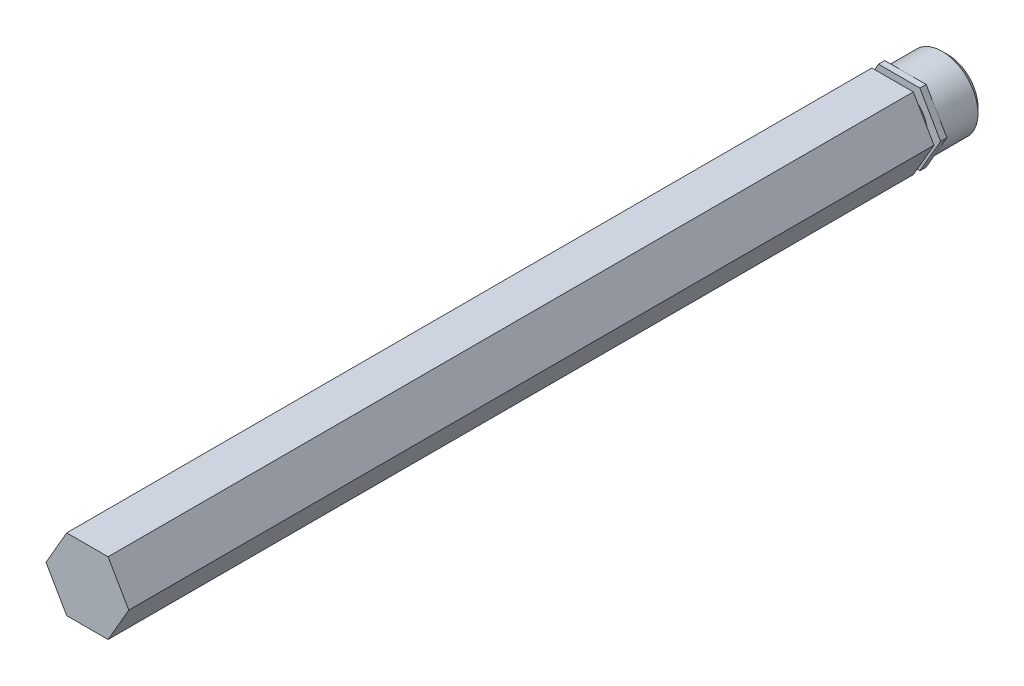
ISO-10303-21;
HEADER;
FILE_DESCRIPTION(('STEP AP214'),'2;1');
FILE_NAME('part.step','',(''),(''),'','','');
FILE_SCHEMA(('AUTOMOTIVE_DESIGN { 1 0 10303 214 1 1 1 1 }'));
ENDSEC;
DATA;
#1=APPLICATION_CONTEXT('core data for automotive mechanical design processes');
#2=APPLICATION_PROTOCOL_DEFINITION('international standard','automotive_design',2000,#1);
#3=PRODUCT_CONTEXT('',#1,'mechanical');
#4=PRODUCT('Part','Part','',(#3));
#5=PRODUCT_RELATED_PRODUCT_CATEGORY('part','',(#4));
#6=PRODUCT_DEFINITION_FORMATION('','',#4);
#7=PRODUCT_DEFINITION_CONTEXT('part definition',#1,'design');
#8=PRODUCT_DEFINITION('design','',#6,#7);
#9=PRODUCT_DEFINITION_SHAPE('','',#8);
#10=(LENGTH_UNIT() NAMED_UNIT(*) SI_UNIT(.MILLI.,.METRE.));
#11=(NAMED_UNIT(*) PLANE_ANGLE_UNIT() SI_UNIT($,.RADIAN.));
#12=(NAMED_UNIT(*) SI_UNIT($,.STERADIAN.) SOLID_ANGLE_UNIT());
#13=UNCERTAINTY_MEASURE_WITH_UNIT(LENGTH_MEASURE(1.E-05),#10,'distance_accuracy_value','');
#14=(GEOMETRIC_REPRESENTATION_CONTEXT(3) GLOBAL_UNCERTAINTY_ASSIGNED_CONTEXT((#13)) GLOBAL_UNIT_ASSIGNED_CONTEXT((#10,
#11,#12)) REPRESENTATION_CONTEXT('',''));
#15=CARTESIAN_POINT('',(0.,0.,0.));
#16=DIRECTION('',(0.,0.,1.));
#17=DIRECTION('',(1.,0.,0.));
#18=AXIS2_PLACEMENT_3D('',#15,#16,#17);
#19=CARTESIAN_POINT('',(7.33234841870824,0.,-76.2));
#20=DIRECTION('',(0.,0.,1.));
#21=DIRECTION('',(1.,0.,0.));
#22=AXIS2_PLACEMENT_3D('',#19,#20,#21);
#23=PLANE('',#22);
#24=CARTESIAN_POINT('',(0.,0.,-76.1999999999716));
#25=DIRECTION('',(0.,0.,1.));
#26=DIRECTION('',(1.,0.,0.));
#27=AXIS2_PLACEMENT_3D('',#24,#25,#26);
#28=CIRCLE('',#27,5.35000000002128);
#29=CARTESIAN_POINT('',(5.35000000002128,0.,-76.1999999999716));
#30=VERTEX_POINT('',#29);
#31=EDGE_CURVE('E20',#30,#30,#28,.T.);
#32=ORIENTED_EDGE('',*,*,#31,.F.);
#33=EDGE_LOOP('',(#32));
#34=FACE_BOUND('',#33,.T.);
#35=ADVANCED_FACE('F17',(#34),#23,.F.);
#36=CARTESIAN_POINT('',(0.,0.,-75.1999999999953));
#37=DIRECTION('',(0.,0.,1.));
#38=DIRECTION('',(1.,0.,0.));
#39=AXIS2_PLACEMENT_3D('',#36,#37,#38);
#40=CONICAL_SURFACE('',#39,6.34999999999764,0.785398163397448);
#41=ORIENTED_EDGE('',*,*,#31,.T.);
#42=EDGE_LOOP('',(#41));
#43=FACE_BOUND('',#42,.T.);
#44=CARTESIAN_POINT('',(0.,0.,-75.2));
#45=DIRECTION('',(0.,0.,-1.));
#46=DIRECTION('',(-1.,0.,0.));
#47=AXIS2_PLACEMENT_3D('',#44,#45,#46);
#48=CIRCLE('',#47,6.35);
#49=CARTESIAN_POINT('',(-6.35,0.,-75.2));
#50=VERTEX_POINT('',#49);
#51=EDGE_CURVE('E134',#50,#50,#48,.F.);
#52=ORIENTED_EDGE('',*,*,#51,.F.);
#53=EDGE_LOOP('',(#52));
#54=FACE_BOUND('',#53,.T.);
#55=ADVANCED_FACE('F504',(#43,#54),#40,.T.);
#56=CARTESIAN_POINT('',(0.,0.,-68.704));
#57=DIRECTION('',(0.,0.,-1.));
#58=DIRECTION('',(-1.,0.,0.));
#59=AXIS2_PLACEMENT_3D('',#56,#57,#58);
#60=CYLINDRICAL_SURFACE('',#59,6.35);
#61=CARTESIAN_POINT('',(0.,0.,-68.704));
#62=DIRECTION('',(0.,0.,-1.));
#63=DIRECTION('',(-1.,0.,0.));
#64=AXIS2_PLACEMENT_3D('',#61,#62,#63);
#65=CIRCLE('',#64,6.35);
#66=CARTESIAN_POINT('',(5.49926131403119,-3.17499999999999,-68.704));
#67=VERTEX_POINT('',#66);
#68=CARTESIAN_POINT('',(5.49926131403118,3.17499999999999,-68.704));
#69=VERTEX_POINT('',#68);
#70=EDGE_CURVE('E121',#67,#69,#65,.F.);
#71=ORIENTED_EDGE('',*,*,#70,.F.);
#72=CARTESIAN_POINT('',(0.,0.,-68.704));
#73=DIRECTION('',(0.,0.,-1.));
#74=DIRECTION('',(-1.,0.,0.));
#75=AXIS2_PLACEMENT_3D('',#72,#73,#74);
#76=CIRCLE('',#75,6.35);
#77=CARTESIAN_POINT('',(0.,-6.35000000000002,-68.704));
#78=VERTEX_POINT('',#77);
#79=EDGE_CURVE('E129',#78,#67,#76,.F.);
#80=ORIENTED_EDGE('',*,*,#79,.F.);
#81=CARTESIAN_POINT('',(0.,0.,-68.704));
#82=DIRECTION('',(0.,0.,-1.));
#83=DIRECTION('',(-1.,0.,0.));
#84=AXIS2_PLACEMENT_3D('',#81,#82,#83);
#85=CIRCLE('',#84,6.35);
#86=CARTESIAN_POINT('',(-5.49926131403119,-3.17500000000001,-68.704));
#87=VERTEX_POINT('',#86);
#88=EDGE_CURVE('E142',#87,#78,#85,.F.);
#89=ORIENTED_EDGE('',*,*,#88,.F.);
#90=CARTESIAN_POINT('',(0.,0.,-68.704));
#91=DIRECTION('',(0.,0.,-1.));
#92=DIRECTION('',(-1.,0.,0.));
#93=AXIS2_PLACEMENT_3D('',#90,#91,#92);
#94=CIRCLE('',#93,6.35);
#95=CARTESIAN_POINT('',(-5.49926131403119,3.175,-68.704));
#96=VERTEX_POINT('',#95);
#97=EDGE_CURVE('E143',#96,#87,#94,.F.);
#98=ORIENTED_EDGE('',*,*,#97,.F.);
#99=CARTESIAN_POINT('',(0.,0.,-68.704));
#100=DIRECTION('',(0.,0.,-1.));
#101=DIRECTION('',(-1.,0.,0.));
#102=AXIS2_PLACEMENT_3D('',#99,#100,#101);
#103=CIRCLE('',#102,6.35);
#104=CARTESIAN_POINT('',(0.,6.35000000000001,-68.704));
#105=VERTEX_POINT('',#104);
#106=EDGE_CURVE('E178',#105,#96,#103,.F.);
#107=ORIENTED_EDGE('',*,*,#106,.F.);
#108=CARTESIAN_POINT('',(0.,0.,-68.704));
#109=DIRECTION('',(0.,0.,-1.));
#110=DIRECTION('',(-1.,0.,0.));
#111=AXIS2_PLACEMENT_3D('',#108,#109,#110);
#112=CIRCLE('',#111,6.35);
#113=EDGE_CURVE('E132',#69,#105,#112,.F.);
#114=ORIENTED_EDGE('',*,*,#113,.F.);
#115=EDGE_LOOP('',(#71,#80,#89,#98,#107,#114));
#116=FACE_BOUND('',#115,.T.);
#117=ORIENTED_EDGE('',*,*,#51,.T.);
#118=EDGE_LOOP('',(#117));
#119=FACE_BOUND('',#118,.T.);
#120=ADVANCED_FACE('F126',(#116,#119),#60,.T.);
#121=CARTESIAN_POINT('',(0.,0.,-68.704));
#122=DIRECTION('',(0.,0.,-1.));
#123=DIRECTION('',(-1.,0.,0.));
#124=AXIS2_PLACEMENT_3D('',#121,#122,#123);
#125=PLANE('',#124);
#126=DIRECTION('',(-0.499999999999999,-0.866025403784439,0.));
#127=VECTOR('',#126,1.);
#128=CARTESIAN_POINT('',(3.6661742093541,-6.35000000000004,-68.704));
#129=LINE('',#128,#127);
#130=CARTESIAN_POINT('',(7.33234841870824,0.,-68.704));
#131=VERTEX_POINT('',#130);
#132=EDGE_CURVE('E149',#131,#67,#129,.T.);
#133=ORIENTED_EDGE('',*,*,#132,.T.);
#134=ORIENTED_EDGE('',*,*,#70,.T.);
#135=DIRECTION('',(0.5,-0.866025403784439,0.));
#136=VECTOR('',#135,1.);
#137=CARTESIAN_POINT('',(7.33234841870824,0.,-68.704));
#138=LINE('',#137,#136);
#139=EDGE_CURVE('E156',#69,#131,#138,.T.);
#140=ORIENTED_EDGE('',*,*,#139,.T.);
#141=EDGE_LOOP('',(#133,#134,#140));
#142=FACE_BOUND('',#141,.T.);
#143=ADVANCED_FACE('F155',(#142),#125,.T.);
#144=CARTESIAN_POINT('',(0.,0.,-68.704));
#145=DIRECTION('',(0.,0.,-1.));
#146=DIRECTION('',(-1.,0.,0.));
#147=AXIS2_PLACEMENT_3D('',#144,#145,#146);
#148=PLANE('',#147);
#149=DIRECTION('',(0.5,-0.866025403784439,0.));
#150=VECTOR('',#149,1.);
#151=CARTESIAN_POINT('',(7.33234841870824,0.,-68.704));
#152=LINE('',#151,#150);
#153=CARTESIAN_POINT('',(3.66617420935411,6.35000000000001,-68.704));
#154=VERTEX_POINT('',#153);
#155=EDGE_CURVE('E153',#154,#69,#152,.T.);
#156=ORIENTED_EDGE('',*,*,#155,.T.);
#157=ORIENTED_EDGE('',*,*,#113,.T.);
#158=DIRECTION('',(1.,0.,0.));
#159=VECTOR('',#158,1.);
#160=CARTESIAN_POINT('',(3.6661742093541,6.35000000000002,-68.704));
#161=LINE('',#160,#159);
#162=EDGE_CURVE('E186',#105,#154,#161,.T.);
#163=ORIENTED_EDGE('',*,*,#162,.T.);
#164=EDGE_LOOP('',(#156,#157,#163));
#165=FACE_BOUND('',#164,.T.);
#166=ADVANCED_FACE('F184',(#165),#148,.T.);
#167=CARTESIAN_POINT('',(0.,0.,-68.704));
#168=DIRECTION('',(0.,0.,-1.));
#169=DIRECTION('',(-1.,0.,0.));
#170=AXIS2_PLACEMENT_3D('',#167,#168,#169);
#171=PLANE('',#170);
#172=ORIENTED_EDGE('',*,*,#106,.T.);
#173=DIRECTION('',(0.5,0.866025403784439,0.));
#174=VECTOR('',#173,1.);
#175=CARTESIAN_POINT('',(-3.66617420935412,6.35000000000002,-68.704));
#176=LINE('',#175,#174);
#177=CARTESIAN_POINT('',(-3.66617420935412,6.35000000000002,-68.704));
#178=VERTEX_POINT('',#177);
#179=EDGE_CURVE('E202',#96,#178,#176,.T.);
#180=ORIENTED_EDGE('',*,*,#179,.T.);
#181=DIRECTION('',(1.,0.,0.));
#182=VECTOR('',#181,1.);
#183=CARTESIAN_POINT('',(3.6661742093541,6.35000000000002,-68.704));
#184=LINE('',#183,#182);
#185=EDGE_CURVE('E195',#178,#105,#184,.T.);
#186=ORIENTED_EDGE('',*,*,#185,.T.);
#187=EDGE_LOOP('',(#172,#180,#186));
#188=FACE_BOUND('',#187,.T.);
#189=ADVANCED_FACE('F201',(#188),#171,.T.);
#190=CARTESIAN_POINT('',(0.,0.,-68.704));
#191=DIRECTION('',(0.,0.,-1.));
#192=DIRECTION('',(-1.,0.,0.));
#193=AXIS2_PLACEMENT_3D('',#190,#191,#192);
#194=PLANE('',#193);
#195=ORIENTED_EDGE('',*,*,#97,.T.);
#196=DIRECTION('',(-0.500000000000001,0.866025403784438,0.));
#197=VECTOR('',#196,1.);
#198=CARTESIAN_POINT('',(-7.33234841870827,0.,-68.704));
#199=LINE('',#198,#197);
#200=CARTESIAN_POINT('',(-7.33234841870827,0.,-68.704));
#201=VERTEX_POINT('',#200);
#202=EDGE_CURVE('E240',#87,#201,#199,.T.);
#203=ORIENTED_EDGE('',*,*,#202,.T.);
#204=DIRECTION('',(0.5,0.866025403784439,0.));
#205=VECTOR('',#204,1.);
#206=CARTESIAN_POINT('',(-3.66617420935412,6.35000000000002,-68.704));
#207=LINE('',#206,#205);
#208=EDGE_CURVE('E214',#201,#96,#207,.T.);
#209=ORIENTED_EDGE('',*,*,#208,.T.);
#210=EDGE_LOOP('',(#195,#203,#209));
#211=FACE_BOUND('',#210,.T.);
#212=ADVANCED_FACE('F468',(#211),#194,.T.);
#213=CARTESIAN_POINT('',(0.,0.,-68.704));
#214=DIRECTION('',(0.,0.,-1.));
#215=DIRECTION('',(-1.,0.,0.));
#216=AXIS2_PLACEMENT_3D('',#213,#214,#215);
#217=PLANE('',#216);
#218=DIRECTION('',(1.,0.,0.));
#219=VECTOR('',#218,1.);
#220=CARTESIAN_POINT('',(-3.66617420935413,-6.35000000000004,-68.704));
#221=LINE('',#220,#219);
#222=CARTESIAN_POINT('',(3.6661742093541,-6.35000000000004,-68.704));
#223=VERTEX_POINT('',#222);
#224=EDGE_CURVE('E141',#223,#78,#221,.F.);
#225=ORIENTED_EDGE('',*,*,#224,.T.);
#226=ORIENTED_EDGE('',*,*,#79,.T.);
#227=DIRECTION('',(-0.499999999999999,-0.866025403784439,0.));
#228=VECTOR('',#227,1.);
#229=CARTESIAN_POINT('',(3.6661742093541,-6.35000000000004,-68.704));
#230=LINE('',#229,#228);
#231=EDGE_CURVE('E139',#67,#223,#230,.T.);
#232=ORIENTED_EDGE('',*,*,#231,.T.);
#233=EDGE_LOOP('',(#225,#226,#232));
#234=FACE_BOUND('',#233,.T.);
#235=ADVANCED_FACE('F138',(#234),#217,.T.);
#236=CARTESIAN_POINT('',(0.,0.,-68.704));
#237=DIRECTION('',(0.,0.,-1.));
#238=DIRECTION('',(-1.,0.,0.));
#239=AXIS2_PLACEMENT_3D('',#236,#237,#238);
#240=PLANE('',#239);
#241=ORIENTED_EDGE('',*,*,#88,.T.);
#242=DIRECTION('',(1.,0.,0.));
#243=VECTOR('',#242,1.);
#244=CARTESIAN_POINT('',(-3.66617420935413,-6.35000000000004,-68.704));
#245=LINE('',#244,#243);
#246=CARTESIAN_POINT('',(-3.66617420935413,-6.35000000000003,-68.704));
#247=VERTEX_POINT('',#246);
#248=EDGE_CURVE('E291',#78,#247,#245,.F.);
#249=ORIENTED_EDGE('',*,*,#248,.T.);
#250=DIRECTION('',(-0.500000000000001,0.866025403784438,0.));
#251=VECTOR('',#250,1.);
#252=CARTESIAN_POINT('',(-7.33234841870827,0.,-68.704));
#253=LINE('',#252,#251);
#254=EDGE_CURVE('E237',#247,#87,#253,.T.);
#255=ORIENTED_EDGE('',*,*,#254,.T.);
#256=EDGE_LOOP('',(#241,#249,#255));
#257=FACE_BOUND('',#256,.T.);
#258=ADVANCED_FACE('F296',(#257),#240,.T.);
#259=CARTESIAN_POINT('',(3.6661742093541,-6.35000000000004,76.2));
#260=DIRECTION('',(-0.866025403784439,0.499999999999999,0.));
#261=DIRECTION('',(-0.499999999999999,-0.866025403784439,0.));
#262=AXIS2_PLACEMENT_3D('',#259,#260,#261);
#263=PLANE('',#262);
#264=DIRECTION('',(0.,0.,1.));
#265=VECTOR('',#264,1.);
#266=CARTESIAN_POINT('',(3.6661742093541,-6.35000000000004,76.2));
#267=LINE('',#266,#265);
#268=CARTESIAN_POINT('',(3.6661742093541,-6.35000000000004,-67.5924));
#269=VERTEX_POINT('',#268);
#270=EDGE_CURVE('E152',#269,#223,#267,.F.);
#271=ORIENTED_EDGE('',*,*,#270,.T.);
#272=ORIENTED_EDGE('',*,*,#231,.F.);
#273=ORIENTED_EDGE('',*,*,#132,.F.);
#274=DIRECTION('',(0.,0.,1.));
#275=VECTOR('',#274,1.);
#276=CARTESIAN_POINT('',(7.33234841870824,0.,76.2));
#277=LINE('',#276,#275);
#278=CARTESIAN_POINT('',(7.33234841870824,0.,-67.5924));
#279=VERTEX_POINT('',#278);
#280=EDGE_CURVE('E203',#131,#279,#277,.T.);
#281=ORIENTED_EDGE('',*,*,#280,.T.);
#282=DIRECTION('',(0.499999999999999,0.866025403784439,0.));
#283=VECTOR('',#282,1.);
#284=CARTESIAN_POINT('',(3.6661742093541,-6.35000000000004,-67.5924));
#285=LINE('',#284,#283);
#286=EDGE_CURVE('E262',#269,#279,#285,.T.);
#287=ORIENTED_EDGE('',*,*,#286,.F.);
#288=EDGE_LOOP('',(#271,#272,#273,#281,#287));
#289=FACE_BOUND('',#288,.T.);
#290=ADVANCED_FACE('F147',(#289),#263,.F.);
#291=CARTESIAN_POINT('',(7.33234841870824,0.,76.2));
#292=DIRECTION('',(-0.866025403784439,-0.5,0.));
#293=DIRECTION('',(0.5,-0.866025403784439,0.));
#294=AXIS2_PLACEMENT_3D('',#291,#292,#293);
#295=PLANE('',#294);
#296=ORIENTED_EDGE('',*,*,#280,.F.);
#297=ORIENTED_EDGE('',*,*,#139,.F.);
#298=ORIENTED_EDGE('',*,*,#155,.F.);
#299=DIRECTION('',(0.,0.,-1.));
#300=VECTOR('',#299,1.);
#301=CARTESIAN_POINT('',(3.6661742093541,6.35000000000002,76.2));
#302=LINE('',#301,#300);
#303=CARTESIAN_POINT('',(3.6661742093541,6.35000000000001,-67.5924));
#304=VERTEX_POINT('',#303);
#305=EDGE_CURVE('E199',#154,#304,#302,.F.);
#306=ORIENTED_EDGE('',*,*,#305,.T.);
#307=DIRECTION('',(-0.5,0.866025403784439,0.));
#308=VECTOR('',#307,1.);
#309=CARTESIAN_POINT('',(7.33234841870824,0.,-67.5924));
#310=LINE('',#309,#308);
#311=EDGE_CURVE('E264',#279,#304,#310,.T.);
#312=ORIENTED_EDGE('',*,*,#311,.F.);
#313=EDGE_LOOP('',(#296,#297,#298,#306,#312));
#314=FACE_BOUND('',#313,.T.);
#315=ADVANCED_FACE('F301',(#314),#295,.F.);
#316=CARTESIAN_POINT('',(3.6661742093541,6.35000000000002,76.2));
#317=DIRECTION('',(0.,-1.,0.));
#318=DIRECTION('',(0.,0.,-1.));
#319=AXIS2_PLACEMENT_3D('',#316,#317,#318);
#320=PLANE('',#319);
#321=ORIENTED_EDGE('',*,*,#305,.F.);
#322=ORIENTED_EDGE('',*,*,#162,.F.);
#323=ORIENTED_EDGE('',*,*,#185,.F.);
#324=DIRECTION('',(0.,0.,1.));
#325=VECTOR('',#324,1.);
#326=CARTESIAN_POINT('',(-3.66617420935412,6.35000000000002,76.2));
#327=LINE('',#326,#325);
#328=CARTESIAN_POINT('',(-3.66617420935412,6.35000000000002,-67.5924));
#329=VERTEX_POINT('',#328);
#330=EDGE_CURVE('E228',#178,#329,#327,.T.);
#331=ORIENTED_EDGE('',*,*,#330,.T.);
#332=DIRECTION('',(1.,0.,0.));
#333=VECTOR('',#332,1.);
#334=CARTESIAN_POINT('',(0.,6.35000000000002,-67.5924));
#335=LINE('',#334,#333);
#336=EDGE_CURVE('E283',#304,#329,#335,.F.);
#337=ORIENTED_EDGE('',*,*,#336,.F.);
#338=EDGE_LOOP('',(#321,#322,#323,#331,#337));
#339=FACE_BOUND('',#338,.T.);
#340=ADVANCED_FACE('F193',(#339),#320,.F.);
#341=CARTESIAN_POINT('',(-3.66617420935412,6.35000000000002,76.2));
#342=DIRECTION('',(0.866025403784439,-0.5,0.));
#343=DIRECTION('',(0.5,0.866025403784439,0.));
#344=AXIS2_PLACEMENT_3D('',#341,#342,#343);
#345=PLANE('',#344);
#346=ORIENTED_EDGE('',*,*,#330,.F.);
#347=ORIENTED_EDGE('',*,*,#179,.F.);
#348=ORIENTED_EDGE('',*,*,#208,.F.);
#349=DIRECTION('',(0.,0.,1.));
#350=VECTOR('',#349,1.);
#351=CARTESIAN_POINT('',(-7.33234841870827,0.,76.2));
#352=LINE('',#351,#350);
#353=CARTESIAN_POINT('',(-7.33234841870827,0.,-67.5924));
#354=VERTEX_POINT('',#353);
#355=EDGE_CURVE('E244',#201,#354,#352,.T.);
#356=ORIENTED_EDGE('',*,*,#355,.T.);
#357=DIRECTION('',(-0.5,-0.866025403784439,0.));
#358=VECTOR('',#357,1.);
#359=CARTESIAN_POINT('',(-3.66617420935412,6.35000000000002,-67.5924));
#360=LINE('',#359,#358);
#361=EDGE_CURVE('E274',#329,#354,#360,.T.);
#362=ORIENTED_EDGE('',*,*,#361,.F.);
#363=EDGE_LOOP('',(#346,#347,#348,#356,#362));
#364=FACE_BOUND('',#363,.T.);
#365=ADVANCED_FACE('F273',(#364),#345,.F.);
#366=CARTESIAN_POINT('',(-7.33234841870827,0.,76.2));
#367=DIRECTION('',(0.866025403784438,0.500000000000001,0.));
#368=DIRECTION('',(-0.500000000000001,0.866025403784438,0.));
#369=AXIS2_PLACEMENT_3D('',#366,#367,#368);
#370=PLANE('',#369);
#371=ORIENTED_EDGE('',*,*,#355,.F.);
#372=ORIENTED_EDGE('',*,*,#202,.F.);
#373=ORIENTED_EDGE('',*,*,#254,.F.);
#374=DIRECTION('',(0.,0.,1.));
#375=VECTOR('',#374,1.);
#376=CARTESIAN_POINT('',(-3.66617420935413,-6.35000000000004,76.2));
#377=LINE('',#376,#375);
#378=CARTESIAN_POINT('',(-3.66617420935413,-6.35000000000004,-67.5924));
#379=VERTEX_POINT('',#378);
#380=EDGE_CURVE('E265',#247,#379,#377,.T.);
#381=ORIENTED_EDGE('',*,*,#380,.T.);
#382=DIRECTION('',(0.500000000000001,-0.866025403784438,0.));
#383=VECTOR('',#382,1.);
#384=CARTESIAN_POINT('',(-7.33234841870827,0.,-67.5924));
#385=LINE('',#384,#383);
#386=EDGE_CURVE('E259',#354,#379,#385,.T.);
#387=ORIENTED_EDGE('',*,*,#386,.F.);
#388=EDGE_LOOP('',(#371,#372,#373,#381,#387));
#389=FACE_BOUND('',#388,.T.);
#390=ADVANCED_FACE('F278',(#389),#370,.F.);
#391=CARTESIAN_POINT('',(-3.66617420935413,-6.35000000000004,76.2));
#392=DIRECTION('',(0.,1.,0.));
#393=DIRECTION('',(0.,0.,1.));
#394=AXIS2_PLACEMENT_3D('',#391,#392,#393);
#395=PLANE('',#394);
#396=ORIENTED_EDGE('',*,*,#380,.F.);
#397=ORIENTED_EDGE('',*,*,#248,.F.);
#398=ORIENTED_EDGE('',*,*,#224,.F.);
#399=ORIENTED_EDGE('',*,*,#270,.F.);
#400=DIRECTION('',(1.,0.,0.));
#401=VECTOR('',#400,1.);
#402=CARTESIAN_POINT('',(0.,-6.35000000000004,-67.5924));
#403=LINE('',#402,#401);
#404=EDGE_CURVE('E175',#379,#269,#403,.T.);
#405=ORIENTED_EDGE('',*,*,#404,.F.);
#406=EDGE_LOOP('',(#396,#397,#398,#399,#405));
#407=FACE_BOUND('',#406,.T.);
#408=ADVANCED_FACE('F298',(#407),#395,.F.);
#409=CARTESIAN_POINT('',(0.,9.67349289505185,-67.5924));
#410=DIRECTION('',(0.,0.,1.));
#411=DIRECTION('',(1.,0.,0.));
#412=AXIS2_PLACEMENT_3D('',#409,#410,#411);
#413=PLANE('',#412);
#414=ORIENTED_EDGE('',*,*,#386,.T.);
#415=ORIENTED_EDGE('',*,*,#404,.T.);
#416=ORIENTED_EDGE('',*,*,#286,.T.);
#417=ORIENTED_EDGE('',*,*,#311,.T.);
#418=ORIENTED_EDGE('',*,*,#336,.T.);
#419=ORIENTED_EDGE('',*,*,#361,.T.);
#420=EDGE_LOOP('',(#414,#415,#416,#417,#418,#419));
#421=FACE_BOUND('',#420,.T.);
#422=CARTESIAN_POINT('',(0.,0.,-67.5924));
#423=DIRECTION('',(0.,0.,1.));
#424=DIRECTION('',(1.,0.,0.));
#425=AXIS2_PLACEMENT_3D('',#422,#423,#424);
#426=CIRCLE('',#425,5.0292);
#427=CARTESIAN_POINT('',(5.0292,0.,-67.5924));
#428=VERTEX_POINT('',#427);
#429=EDGE_CURVE('E172',#428,#428,#426,.T.);
#430=ORIENTED_EDGE('',*,*,#429,.F.);
#431=EDGE_LOOP('',(#430));
#432=FACE_BOUND('',#431,.T.);
#433=ADVANCED_FACE('F299',(#421,#432),#413,.T.);
#434=CARTESIAN_POINT('',(0.,0.,-56.8163271417919));
#435=DIRECTION('',(0.,0.,1.));
#436=DIRECTION('',(1.,0.,0.));
#437=AXIS2_PLACEMENT_3D('',#434,#435,#436);
#438=CYLINDRICAL_SURFACE('',#437,5.0292);
#439=ORIENTED_EDGE('',*,*,#429,.T.);
#440=EDGE_LOOP('',(#439));
#441=FACE_BOUND('',#440,.T.);
#442=CARTESIAN_POINT('',(0.,0.,-66.424));
#443=DIRECTION('',(0.,0.,1.));
#444=DIRECTION('',(1.,0.,0.));
#445=AXIS2_PLACEMENT_3D('',#442,#443,#444);
#446=CIRCLE('',#445,5.0292);
#447=CARTESIAN_POINT('',(5.0292,0.,-66.424));
#448=VERTEX_POINT('',#447);
#449=EDGE_CURVE('E167',#448,#448,#446,.T.);
#450=ORIENTED_EDGE('',*,*,#449,.F.);
#451=EDGE_LOOP('',(#450));
#452=FACE_BOUND('',#451,.T.);
#453=ADVANCED_FACE('F345',(#441,#452),#438,.T.);
#454=CARTESIAN_POINT('',(3.6661742093541,-6.35000000000004,76.2));
#455=DIRECTION('',(-0.866025403784439,0.499999999999999,0.));
#456=DIRECTION('',(-0.499999999999999,-0.866025403784439,0.));
#457=AXIS2_PLACEMENT_3D('',#454,#455,#456);
#458=PLANE('',#457);
#459=DIRECTION('',(0.,0.,1.));
#460=VECTOR('',#459,1.);
#461=CARTESIAN_POINT('',(7.33234841870824,0.,76.2));
#462=LINE('',#461,#460);
#463=CARTESIAN_POINT('',(7.33234841870824,0.,-66.424));
#464=VERTEX_POINT('',#463);
#465=CARTESIAN_POINT('',(7.33234841870824,0.,76.2));
#466=VERTEX_POINT('',#465);
#467=EDGE_CURVE('E541',#464,#466,#462,.T.);
#468=ORIENTED_EDGE('',*,*,#467,.T.);
#469=DIRECTION('',(0.499999999999999,0.866025403784439,0.));
#470=VECTOR('',#469,1.);
#471=CARTESIAN_POINT('',(3.6661742093541,-6.35000000000004,76.2));
#472=LINE('',#471,#470);
#473=CARTESIAN_POINT('',(3.6661742093541,-6.35000000000004,76.2));
#474=VERTEX_POINT('',#473);
#475=EDGE_CURVE('E544',#474,#466,#472,.T.);
#476=ORIENTED_EDGE('',*,*,#475,.F.);
#477=DIRECTION('',(0.,0.,1.));
#478=VECTOR('',#477,1.);
#479=CARTESIAN_POINT('',(3.6661742093541,-6.35000000000004,76.2));
#480=LINE('',#479,#478);
#481=CARTESIAN_POINT('',(3.6661742093541,-6.35000000000004,-66.424));
#482=VERTEX_POINT('',#481);
#483=EDGE_CURVE('E174',#474,#482,#480,.F.);
#484=ORIENTED_EDGE('',*,*,#483,.T.);
#485=DIRECTION('',(-0.499999999999999,-0.866025403784439,0.));
#486=VECTOR('',#485,1.);
#487=CARTESIAN_POINT('',(7.33234841870824,0.,-66.424));
#488=LINE('',#487,#486);
#489=EDGE_CURVE('E170',#464,#482,#488,.T.);
#490=ORIENTED_EDGE('',*,*,#489,.F.);
#491=EDGE_LOOP('',(#468,#476,#484,#490));
#492=FACE_BOUND('',#491,.T.);
#493=ADVANCED_FACE('F341',(#492),#458,.F.);
#494=CARTESIAN_POINT('',(-3.66617420935413,-6.35000000000004,76.2));
#495=DIRECTION('',(0.,1.,0.));
#496=DIRECTION('',(0.,0.,1.));
#497=AXIS2_PLACEMENT_3D('',#494,#495,#496);
#498=PLANE('',#497);
#499=ORIENTED_EDGE('',*,*,#483,.F.);
#500=DIRECTION('',(1.,0.,0.));
#501=VECTOR('',#500,1.);
#502=CARTESIAN_POINT('',(7.33234841870824,-6.35000000000004,76.2));
#503=LINE('',#502,#501);
#504=CARTESIAN_POINT('',(-3.66617420935413,-6.35000000000004,76.2));
#505=VERTEX_POINT('',#504);
#506=EDGE_CURVE('E553',#505,#474,#503,.T.);
#507=ORIENTED_EDGE('',*,*,#506,.F.);
#508=DIRECTION('',(0.,0.,1.));
#509=VECTOR('',#508,1.);
#510=CARTESIAN_POINT('',(-3.66617420935413,-6.35000000000004,76.2));
#511=LINE('',#510,#509);
#512=CARTESIAN_POINT('',(-3.66617420935413,-6.35000000000004,-66.424));
#513=VERTEX_POINT('',#512);
#514=EDGE_CURVE('E171',#505,#513,#511,.F.);
#515=ORIENTED_EDGE('',*,*,#514,.T.);
#516=DIRECTION('',(-1.,0.,0.));
#517=VECTOR('',#516,1.);
#518=CARTESIAN_POINT('',(0.,-6.35000000000004,-66.424));
#519=LINE('',#518,#517);
#520=EDGE_CURVE('E566',#482,#513,#519,.T.);
#521=ORIENTED_EDGE('',*,*,#520,.F.);
#522=EDGE_LOOP('',(#499,#507,#515,#521));
#523=FACE_BOUND('',#522,.T.);
#524=ADVANCED_FACE('F337',(#523),#498,.F.);
#525=CARTESIAN_POINT('',(7.33234841870824,0.,76.2));
#526=DIRECTION('',(-0.866025403784439,-0.5,0.));
#527=DIRECTION('',(0.5,-0.866025403784439,0.));
#528=AXIS2_PLACEMENT_3D('',#525,#526,#527);
#529=PLANE('',#528);
#530=DIRECTION('',(0.,0.,-1.));
#531=VECTOR('',#530,1.);
#532=CARTESIAN_POINT('',(3.6661742093541,6.35000000000002,76.2));
#533=LINE('',#532,#531);
#534=CARTESIAN_POINT('',(3.6661742093541,6.35000000000002,-66.424));
#535=VERTEX_POINT('',#534);
#536=CARTESIAN_POINT('',(3.6661742093541,6.35000000000001,76.2));
#537=VERTEX_POINT('',#536);
#538=EDGE_CURVE('E547',#535,#537,#533,.F.);
#539=ORIENTED_EDGE('',*,*,#538,.T.);
#540=DIRECTION('',(-0.5,0.866025403784439,0.));
#541=VECTOR('',#540,1.);
#542=CARTESIAN_POINT('',(7.33234841870824,0.,76.2));
#543=LINE('',#542,#541);
#544=EDGE_CURVE('E549',#466,#537,#543,.T.);
#545=ORIENTED_EDGE('',*,*,#544,.F.);
#546=ORIENTED_EDGE('',*,*,#467,.F.);
#547=DIRECTION('',(0.5,-0.866025403784439,0.));
#548=VECTOR('',#547,1.);
#549=CARTESIAN_POINT('',(3.6661742093541,6.35000000000002,-66.424));
#550=LINE('',#549,#548);
#551=EDGE_CURVE('E572',#535,#464,#550,.T.);
#552=ORIENTED_EDGE('',*,*,#551,.F.);
#553=EDGE_LOOP('',(#539,#545,#546,#552));
#554=FACE_BOUND('',#553,.T.);
#555=ADVANCED_FACE('F333',(#554),#529,.F.);
#556=CARTESIAN_POINT('',(3.6661742093541,6.35000000000002,76.2));
#557=DIRECTION('',(0.,-1.,0.));
#558=DIRECTION('',(0.,0.,-1.));
#559=AXIS2_PLACEMENT_3D('',#556,#557,#558);
#560=PLANE('',#559);
#561=DIRECTION('',(0.,0.,1.));
#562=VECTOR('',#561,1.);
#563=CARTESIAN_POINT('',(-3.66617420935412,6.35000000000002,76.2));
#564=LINE('',#563,#562);
#565=CARTESIAN_POINT('',(-3.66617420935412,6.35000000000002,-66.424));
#566=VERTEX_POINT('',#565);
#567=CARTESIAN_POINT('',(-3.66617420935412,6.35000000000002,76.2));
#568=VERTEX_POINT('',#567);
#569=EDGE_CURVE('E574',#566,#568,#564,.T.);
#570=ORIENTED_EDGE('',*,*,#569,.T.);
#571=DIRECTION('',(1.,0.,0.));
#572=VECTOR('',#571,1.);
#573=CARTESIAN_POINT('',(7.33234841870824,6.35000000000002,76.2));
#574=LINE('',#573,#572);
#575=EDGE_CURVE('E551',#537,#568,#574,.F.);
#576=ORIENTED_EDGE('',*,*,#575,.F.);
#577=ORIENTED_EDGE('',*,*,#538,.F.);
#578=DIRECTION('',(-1.,0.,0.));
#579=VECTOR('',#578,1.);
#580=CARTESIAN_POINT('',(0.,6.35000000000002,-66.424));
#581=LINE('',#580,#579);
#582=EDGE_CURVE('E569',#566,#535,#581,.F.);
#583=ORIENTED_EDGE('',*,*,#582,.F.);
#584=EDGE_LOOP('',(#570,#576,#577,#583));
#585=FACE_BOUND('',#584,.T.);
#586=ADVANCED_FACE('F329',(#585),#560,.F.);
#587=CARTESIAN_POINT('',(7.33234841870824,0.,76.2));
#588=DIRECTION('',(0.,0.,1.));
#589=DIRECTION('',(1.,0.,0.));
#590=AXIS2_PLACEMENT_3D('',#587,#588,#589);
#591=PLANE('',#590);
#592=DIRECTION('',(-0.500000000000001,0.866025403784438,0.));
#593=VECTOR('',#592,1.);
#594=CARTESIAN_POINT('',(-7.33234841870827,0.,76.2));
#595=LINE('',#594,#593);
#596=CARTESIAN_POINT('',(-7.33234841870827,0.,76.2));
#597=VERTEX_POINT('',#596);
#598=EDGE_CURVE('E560',#597,#505,#595,.F.);
#599=ORIENTED_EDGE('',*,*,#598,.T.);
#600=ORIENTED_EDGE('',*,*,#506,.T.);
#601=ORIENTED_EDGE('',*,*,#475,.T.);
#602=ORIENTED_EDGE('',*,*,#544,.T.);
#603=ORIENTED_EDGE('',*,*,#575,.T.);
#604=DIRECTION('',(0.5,0.866025403784439,0.));
#605=VECTOR('',#604,1.);
#606=CARTESIAN_POINT('',(-3.66617420935412,6.35000000000002,76.2));
#607=LINE('',#606,#605);
#608=EDGE_CURVE('E577',#568,#597,#607,.F.);
#609=ORIENTED_EDGE('',*,*,#608,.T.);
#610=EDGE_LOOP('',(#599,#600,#601,#602,#603,#609));
#611=FACE_BOUND('',#610,.T.);
#612=ADVANCED_FACE('F325',(#611),#591,.T.);
#613=CARTESIAN_POINT('',(-7.33234841870827,0.,76.2));
#614=DIRECTION('',(0.866025403784438,0.500000000000001,0.));
#615=DIRECTION('',(-0.500000000000001,0.866025403784438,0.));
#616=AXIS2_PLACEMENT_3D('',#613,#614,#615);
#617=PLANE('',#616);
#618=ORIENTED_EDGE('',*,*,#514,.F.);
#619=ORIENTED_EDGE('',*,*,#598,.F.);
#620=DIRECTION('',(0.,0.,1.));
#621=VECTOR('',#620,1.);
#622=CARTESIAN_POINT('',(-7.33234841870827,0.,76.2));
#623=LINE('',#622,#621);
#624=CARTESIAN_POINT('',(-7.33234841870827,0.,-66.424));
#625=VERTEX_POINT('',#624);
#626=EDGE_CURVE('E26',#597,#625,#623,.F.);
#627=ORIENTED_EDGE('',*,*,#626,.T.);
#628=DIRECTION('',(-0.500000000000001,0.866025403784438,0.));
#629=VECTOR('',#628,1.);
#630=CARTESIAN_POINT('',(-3.66617420935413,-6.35000000000004,-66.424));
#631=LINE('',#630,#629);
#632=EDGE_CURVE('E34',#513,#625,#631,.T.);
#633=ORIENTED_EDGE('',*,*,#632,.F.);
#634=EDGE_LOOP('',(#618,#619,#627,#633));
#635=FACE_BOUND('',#634,.T.);
#636=ADVANCED_FACE('F319',(#635),#617,.F.);
#637=CARTESIAN_POINT('',(0.,9.67349289505185,-66.424));
#638=DIRECTION('',(0.,0.,-1.));
#639=DIRECTION('',(-1.,0.,0.));
#640=AXIS2_PLACEMENT_3D('',#637,#638,#639);
#641=PLANE('',#640);
#642=ORIENTED_EDGE('',*,*,#582,.T.);
#643=ORIENTED_EDGE('',*,*,#551,.T.);
#644=ORIENTED_EDGE('',*,*,#489,.T.);
#645=ORIENTED_EDGE('',*,*,#520,.T.);
#646=ORIENTED_EDGE('',*,*,#632,.T.);
#647=DIRECTION('',(0.5,0.866025403784439,0.));
#648=VECTOR('',#647,1.);
#649=CARTESIAN_POINT('',(-3.66617420935412,6.35000000000002,-66.424));
#650=LINE('',#649,#648);
#651=EDGE_CURVE('E11',#625,#566,#650,.T.);
#652=ORIENTED_EDGE('',*,*,#651,.T.);
#653=EDGE_LOOP('',(#642,#643,#644,#645,#646,#652));
#654=FACE_BOUND('',#653,.T.);
#655=ORIENTED_EDGE('',*,*,#449,.T.);
#656=EDGE_LOOP('',(#655));
#657=FACE_BOUND('',#656,.T.);
#658=ADVANCED_FACE('F313',(#654,#657),#641,.T.);
#659=CARTESIAN_POINT('',(-3.66617420935412,6.35000000000002,76.2));
#660=DIRECTION('',(0.866025403784439,-0.5,0.));
#661=DIRECTION('',(0.5,0.866025403784439,0.));
#662=AXIS2_PLACEMENT_3D('',#659,#660,#661);
#663=PLANE('',#662);
#664=ORIENTED_EDGE('',*,*,#626,.F.);
#665=ORIENTED_EDGE('',*,*,#608,.F.);
#666=ORIENTED_EDGE('',*,*,#569,.F.);
#667=ORIENTED_EDGE('',*,*,#651,.F.);
#668=EDGE_LOOP('',(#664,#665,#666,#667));
#669=FACE_BOUND('',#668,.T.);
#670=ADVANCED_FACE('F311',(#669),#663,.F.);
#671=CLOSED_SHELL('',(#35,#55,#120,#143,#166,#189,#212,#235,#258,#290,#315,#340,#365,#390,#408,
#433,#453,#493,#524,#555,#586,#612,#636,#658,#670));
#672=MANIFOLD_SOLID_BREP('B1',#671);
#673=ADVANCED_BREP_SHAPE_REPRESENTATION('',(#18,#672),#14);
#674=SHAPE_DEFINITION_REPRESENTATION(#9,#673);
ENDSEC;
END-ISO-10303-21;
